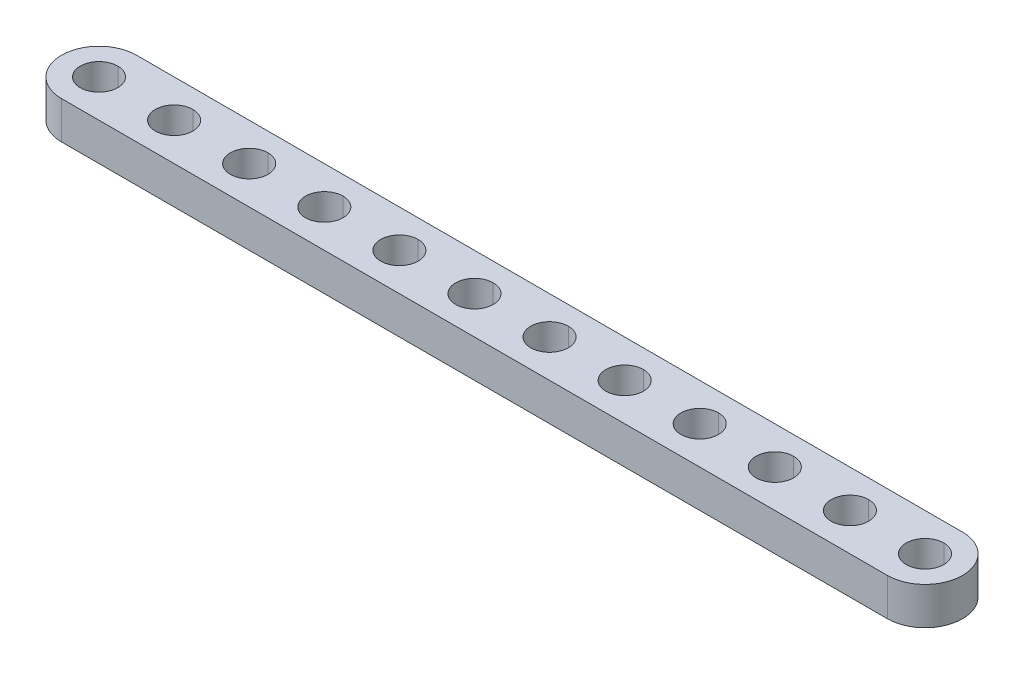
ISO-10303-21;
HEADER;
FILE_DESCRIPTION(('STEP AP214'),'2;1');
FILE_NAME('part.step','',(''),(''),'','','');
FILE_SCHEMA(('AUTOMOTIVE_DESIGN { 1 0 10303 214 1 1 1 1 }'));
ENDSEC;
DATA;
#1=APPLICATION_CONTEXT('core data for automotive mechanical design processes');
#2=APPLICATION_PROTOCOL_DEFINITION('international standard','automotive_design',2000,#1);
#3=PRODUCT_CONTEXT('',#1,'mechanical');
#4=PRODUCT('Part','Part','',(#3));
#5=PRODUCT_RELATED_PRODUCT_CATEGORY('part','',(#4));
#6=PRODUCT_DEFINITION_FORMATION('','',#4);
#7=PRODUCT_DEFINITION_CONTEXT('part definition',#1,'design');
#8=PRODUCT_DEFINITION('design','',#6,#7);
#9=PRODUCT_DEFINITION_SHAPE('','',#8);
#10=(LENGTH_UNIT() NAMED_UNIT(*) SI_UNIT(.MILLI.,.METRE.));
#11=(NAMED_UNIT(*) PLANE_ANGLE_UNIT() SI_UNIT($,.RADIAN.));
#12=(NAMED_UNIT(*) SI_UNIT($,.STERADIAN.) SOLID_ANGLE_UNIT());
#13=UNCERTAINTY_MEASURE_WITH_UNIT(LENGTH_MEASURE(1.E-05),#10,'distance_accuracy_value','');
#14=(GEOMETRIC_REPRESENTATION_CONTEXT(3) GLOBAL_UNCERTAINTY_ASSIGNED_CONTEXT((#13)) GLOBAL_UNIT_ASSIGNED_CONTEXT((#10,
#11,#12)) REPRESENTATION_CONTEXT('',''));
#15=CARTESIAN_POINT('',(0.,0.,0.));
#16=DIRECTION('',(0.,0.,1.));
#17=DIRECTION('',(1.,0.,0.));
#18=AXIS2_PLACEMENT_3D('',#15,#16,#17);
#19=CARTESIAN_POINT('',(44.,4.,0.));
#20=DIRECTION('',(0.,1.,0.));
#21=DIRECTION('',(0.,0.,1.));
#22=AXIS2_PLACEMENT_3D('',#19,#20,#21);
#23=CYLINDRICAL_SURFACE('',#22,2.);
#24=DIRECTION('',(0.,1.,0.));
#25=VECTOR('',#24,1.);
#26=CARTESIAN_POINT('',(44.,4.,-2.));
#27=LINE('',#26,#25);
#28=CARTESIAN_POINT('',(44.,0.,-2.));
#29=VERTEX_POINT('',#28);
#30=CARTESIAN_POINT('',(44.,4.,-2.));
#31=VERTEX_POINT('',#30);
#32=EDGE_CURVE('E379',#29,#31,#27,.T.);
#33=ORIENTED_EDGE('',*,*,#32,.F.);
#34=CARTESIAN_POINT('',(44.,0.,0.));
#35=DIRECTION('',(0.,1.,0.));
#36=DIRECTION('',(0.,0.,1.));
#37=AXIS2_PLACEMENT_3D('',#34,#35,#36);
#38=CIRCLE('',#37,2.);
#39=CARTESIAN_POINT('',(44.,0.,2.));
#40=VERTEX_POINT('',#39);
#41=EDGE_CURVE('E300',#40,#29,#38,.T.);
#42=ORIENTED_EDGE('',*,*,#41,.F.);
#43=DIRECTION('',(0.,1.,0.));
#44=VECTOR('',#43,1.);
#45=CARTESIAN_POINT('',(44.,4.,2.));
#46=LINE('',#45,#44);
#47=CARTESIAN_POINT('',(44.,4.,2.));
#48=VERTEX_POINT('',#47);
#49=EDGE_CURVE('E363',#40,#48,#46,.T.);
#50=ORIENTED_EDGE('',*,*,#49,.T.);
#51=CARTESIAN_POINT('',(44.,4.,0.));
#52=DIRECTION('',(0.,1.,0.));
#53=DIRECTION('',(0.,0.,1.));
#54=AXIS2_PLACEMENT_3D('',#51,#52,#53);
#55=CIRCLE('',#54,2.);
#56=EDGE_CURVE('E308',#48,#31,#55,.T.);
#57=ORIENTED_EDGE('',*,*,#56,.T.);
#58=EDGE_LOOP('',(#33,#42,#50,#57));
#59=FACE_BOUND('',#58,.T.);
#60=ADVANCED_FACE('F14',(#59),#23,.F.);
#61=CARTESIAN_POINT('',(36.,4.,0.));
#62=DIRECTION('',(0.,1.,0.));
#63=DIRECTION('',(0.,0.,1.));
#64=AXIS2_PLACEMENT_3D('',#61,#62,#63);
#65=CYLINDRICAL_SURFACE('',#64,2.);
#66=DIRECTION('',(0.,1.,0.));
#67=VECTOR('',#66,1.);
#68=CARTESIAN_POINT('',(36.,4.,-2.));
#69=LINE('',#68,#67);
#70=CARTESIAN_POINT('',(36.,0.,-2.));
#71=VERTEX_POINT('',#70);
#72=CARTESIAN_POINT('',(36.,4.,-2.));
#73=VERTEX_POINT('',#72);
#74=EDGE_CURVE('E332',#71,#73,#69,.T.);
#75=ORIENTED_EDGE('',*,*,#74,.F.);
#76=CARTESIAN_POINT('',(36.,0.,0.));
#77=DIRECTION('',(0.,1.,0.));
#78=DIRECTION('',(0.,0.,1.));
#79=AXIS2_PLACEMENT_3D('',#76,#77,#78);
#80=CIRCLE('',#79,2.);
#81=CARTESIAN_POINT('',(36.,0.,2.));
#82=VERTEX_POINT('',#81);
#83=EDGE_CURVE('E312',#82,#71,#80,.T.);
#84=ORIENTED_EDGE('',*,*,#83,.F.);
#85=DIRECTION('',(0.,1.,0.));
#86=VECTOR('',#85,1.);
#87=CARTESIAN_POINT('',(36.,4.,2.));
#88=LINE('',#87,#86);
#89=CARTESIAN_POINT('',(36.,4.,2.));
#90=VERTEX_POINT('',#89);
#91=EDGE_CURVE('E331',#82,#90,#88,.T.);
#92=ORIENTED_EDGE('',*,*,#91,.T.);
#93=CARTESIAN_POINT('',(36.,4.,0.));
#94=DIRECTION('',(0.,1.,0.));
#95=DIRECTION('',(0.,0.,1.));
#96=AXIS2_PLACEMENT_3D('',#93,#94,#95);
#97=CIRCLE('',#96,2.);
#98=EDGE_CURVE('E311',#90,#73,#97,.T.);
#99=ORIENTED_EDGE('',*,*,#98,.T.);
#100=EDGE_LOOP('',(#75,#84,#92,#99));
#101=FACE_BOUND('',#100,.T.);
#102=ADVANCED_FACE('F16',(#101),#65,.F.);
#103=CARTESIAN_POINT('',(28.,4.,0.));
#104=DIRECTION('',(0.,1.,0.));
#105=DIRECTION('',(0.,0.,1.));
#106=AXIS2_PLACEMENT_3D('',#103,#104,#105);
#107=CYLINDRICAL_SURFACE('',#106,2.);
#108=DIRECTION('',(0.,1.,0.));
#109=VECTOR('',#108,1.);
#110=CARTESIAN_POINT('',(28.,4.,-2.));
#111=LINE('',#110,#109);
#112=CARTESIAN_POINT('',(28.,0.,-2.));
#113=VERTEX_POINT('',#112);
#114=CARTESIAN_POINT('',(28.,4.,-2.));
#115=VERTEX_POINT('',#114);
#116=EDGE_CURVE('E351',#113,#115,#111,.T.);
#117=ORIENTED_EDGE('',*,*,#116,.F.);
#118=CARTESIAN_POINT('',(28.,0.,0.));
#119=DIRECTION('',(0.,1.,0.));
#120=DIRECTION('',(0.,0.,1.));
#121=AXIS2_PLACEMENT_3D('',#118,#119,#120);
#122=CIRCLE('',#121,2.);
#123=CARTESIAN_POINT('',(28.,0.,2.));
#124=VERTEX_POINT('',#123);
#125=EDGE_CURVE('E315',#124,#113,#122,.T.);
#126=ORIENTED_EDGE('',*,*,#125,.F.);
#127=DIRECTION('',(0.,1.,0.));
#128=VECTOR('',#127,1.);
#129=CARTESIAN_POINT('',(28.,4.,2.));
#130=LINE('',#129,#128);
#131=CARTESIAN_POINT('',(28.,4.,2.));
#132=VERTEX_POINT('',#131);
#133=EDGE_CURVE('E302',#124,#132,#130,.T.);
#134=ORIENTED_EDGE('',*,*,#133,.T.);
#135=CARTESIAN_POINT('',(28.,4.,0.));
#136=DIRECTION('',(0.,1.,0.));
#137=DIRECTION('',(0.,0.,1.));
#138=AXIS2_PLACEMENT_3D('',#135,#136,#137);
#139=CIRCLE('',#138,2.);
#140=EDGE_CURVE('E480',#132,#115,#139,.T.);
#141=ORIENTED_EDGE('',*,*,#140,.T.);
#142=EDGE_LOOP('',(#117,#126,#134,#141));
#143=FACE_BOUND('',#142,.T.);
#144=ADVANCED_FACE('F807',(#143),#107,.F.);
#145=CARTESIAN_POINT('',(20.,4.,0.));
#146=DIRECTION('',(0.,1.,0.));
#147=DIRECTION('',(0.,0.,1.));
#148=AXIS2_PLACEMENT_3D('',#145,#146,#147);
#149=CYLINDRICAL_SURFACE('',#148,2.);
#150=DIRECTION('',(0.,1.,0.));
#151=VECTOR('',#150,1.);
#152=CARTESIAN_POINT('',(20.,4.,-2.));
#153=LINE('',#152,#151);
#154=CARTESIAN_POINT('',(20.,0.,-2.));
#155=VERTEX_POINT('',#154);
#156=CARTESIAN_POINT('',(20.,4.,-2.));
#157=VERTEX_POINT('',#156);
#158=EDGE_CURVE('E384',#155,#157,#153,.T.);
#159=ORIENTED_EDGE('',*,*,#158,.F.);
#160=CARTESIAN_POINT('',(20.,0.,0.));
#161=DIRECTION('',(0.,1.,0.));
#162=DIRECTION('',(0.,0.,1.));
#163=AXIS2_PLACEMENT_3D('',#160,#161,#162);
#164=CIRCLE('',#163,2.);
#165=CARTESIAN_POINT('',(20.,0.,2.));
#166=VERTEX_POINT('',#165);
#167=EDGE_CURVE('E435',#166,#155,#164,.T.);
#168=ORIENTED_EDGE('',*,*,#167,.F.);
#169=DIRECTION('',(0.,1.,0.));
#170=VECTOR('',#169,1.);
#171=CARTESIAN_POINT('',(20.,4.,2.));
#172=LINE('',#171,#170);
#173=CARTESIAN_POINT('',(20.,4.,2.));
#174=VERTEX_POINT('',#173);
#175=EDGE_CURVE('E342',#166,#174,#172,.T.);
#176=ORIENTED_EDGE('',*,*,#175,.T.);
#177=CARTESIAN_POINT('',(20.,4.,0.));
#178=DIRECTION('',(0.,1.,0.));
#179=DIRECTION('',(0.,0.,1.));
#180=AXIS2_PLACEMENT_3D('',#177,#178,#179);
#181=CIRCLE('',#180,2.);
#182=EDGE_CURVE('E508',#174,#157,#181,.T.);
#183=ORIENTED_EDGE('',*,*,#182,.T.);
#184=EDGE_LOOP('',(#159,#168,#176,#183));
#185=FACE_BOUND('',#184,.T.);
#186=ADVANCED_FACE('F870',(#185),#149,.F.);
#187=CARTESIAN_POINT('',(12.,4.,0.));
#188=DIRECTION('',(0.,1.,0.));
#189=DIRECTION('',(0.,0.,1.));
#190=AXIS2_PLACEMENT_3D('',#187,#188,#189);
#191=CYLINDRICAL_SURFACE('',#190,2.);
#192=DIRECTION('',(0.,1.,0.));
#193=VECTOR('',#192,1.);
#194=CARTESIAN_POINT('',(12.,4.,-2.));
#195=LINE('',#194,#193);
#196=CARTESIAN_POINT('',(12.,0.,-2.));
#197=VERTEX_POINT('',#196);
#198=CARTESIAN_POINT('',(12.,4.,-2.));
#199=VERTEX_POINT('',#198);
#200=EDGE_CURVE('E341',#197,#199,#195,.T.);
#201=ORIENTED_EDGE('',*,*,#200,.F.);
#202=CARTESIAN_POINT('',(12.,0.,0.));
#203=DIRECTION('',(0.,1.,0.));
#204=DIRECTION('',(0.,0.,1.));
#205=AXIS2_PLACEMENT_3D('',#202,#203,#204);
#206=CIRCLE('',#205,2.);
#207=CARTESIAN_POINT('',(12.,0.,2.));
#208=VERTEX_POINT('',#207);
#209=EDGE_CURVE('E432',#208,#197,#206,.T.);
#210=ORIENTED_EDGE('',*,*,#209,.F.);
#211=DIRECTION('',(0.,1.,0.));
#212=VECTOR('',#211,1.);
#213=CARTESIAN_POINT('',(12.,4.,2.));
#214=LINE('',#213,#212);
#215=CARTESIAN_POINT('',(12.,4.,2.));
#216=VERTEX_POINT('',#215);
#217=EDGE_CURVE('E492',#208,#216,#214,.T.);
#218=ORIENTED_EDGE('',*,*,#217,.T.);
#219=CARTESIAN_POINT('',(12.,4.,0.));
#220=DIRECTION('',(0.,1.,0.));
#221=DIRECTION('',(0.,0.,1.));
#222=AXIS2_PLACEMENT_3D('',#219,#220,#221);
#223=CIRCLE('',#222,2.);
#224=EDGE_CURVE('E511',#216,#199,#223,.T.);
#225=ORIENTED_EDGE('',*,*,#224,.T.);
#226=EDGE_LOOP('',(#201,#210,#218,#225));
#227=FACE_BOUND('',#226,.T.);
#228=ADVANCED_FACE('F817',(#227),#191,.F.);
#229=CARTESIAN_POINT('',(4.,4.,0.));
#230=DIRECTION('',(0.,1.,0.));
#231=DIRECTION('',(0.,0.,1.));
#232=AXIS2_PLACEMENT_3D('',#229,#230,#231);
#233=CYLINDRICAL_SURFACE('',#232,2.);
#234=DIRECTION('',(0.,1.,0.));
#235=VECTOR('',#234,1.);
#236=CARTESIAN_POINT('',(4.,4.,-2.));
#237=LINE('',#236,#235);
#238=CARTESIAN_POINT('',(4.,0.,-2.));
#239=VERTEX_POINT('',#238);
#240=CARTESIAN_POINT('',(4.,4.,-2.));
#241=VERTEX_POINT('',#240);
#242=EDGE_CURVE('E316',#239,#241,#237,.T.);
#243=ORIENTED_EDGE('',*,*,#242,.F.);
#244=CARTESIAN_POINT('',(4.,0.,0.));
#245=DIRECTION('',(0.,1.,0.));
#246=DIRECTION('',(0.,0.,1.));
#247=AXIS2_PLACEMENT_3D('',#244,#245,#246);
#248=CIRCLE('',#247,2.);
#249=CARTESIAN_POINT('',(4.,0.,2.));
#250=VERTEX_POINT('',#249);
#251=EDGE_CURVE('E395',#250,#239,#248,.T.);
#252=ORIENTED_EDGE('',*,*,#251,.F.);
#253=DIRECTION('',(0.,1.,0.));
#254=VECTOR('',#253,1.);
#255=CARTESIAN_POINT('',(4.,4.,2.));
#256=LINE('',#255,#254);
#257=CARTESIAN_POINT('',(4.,4.,2.));
#258=VERTEX_POINT('',#257);
#259=EDGE_CURVE('E444',#250,#258,#256,.T.);
#260=ORIENTED_EDGE('',*,*,#259,.T.);
#261=CARTESIAN_POINT('',(4.,4.,0.));
#262=DIRECTION('',(0.,1.,0.));
#263=DIRECTION('',(0.,0.,1.));
#264=AXIS2_PLACEMENT_3D('',#261,#262,#263);
#265=CIRCLE('',#264,2.);
#266=EDGE_CURVE('E362',#258,#241,#265,.T.);
#267=ORIENTED_EDGE('',*,*,#266,.T.);
#268=EDGE_LOOP('',(#243,#252,#260,#267));
#269=FACE_BOUND('',#268,.T.);
#270=ADVANCED_FACE('F812',(#269),#233,.F.);
#271=CARTESIAN_POINT('',(-4.,4.,0.));
#272=DIRECTION('',(0.,1.,0.));
#273=DIRECTION('',(0.,0.,1.));
#274=AXIS2_PLACEMENT_3D('',#271,#272,#273);
#275=CYLINDRICAL_SURFACE('',#274,2.);
#276=DIRECTION('',(0.,1.,0.));
#277=VECTOR('',#276,1.);
#278=CARTESIAN_POINT('',(-4.,4.,-2.));
#279=LINE('',#278,#277);
#280=CARTESIAN_POINT('',(-4.,0.,-2.));
#281=VERTEX_POINT('',#280);
#282=CARTESIAN_POINT('',(-4.,4.,-2.));
#283=VERTEX_POINT('',#282);
#284=EDGE_CURVE('E453',#281,#283,#279,.T.);
#285=ORIENTED_EDGE('',*,*,#284,.F.);
#286=CARTESIAN_POINT('',(-4.,0.,0.));
#287=DIRECTION('',(0.,1.,0.));
#288=DIRECTION('',(0.,0.,1.));
#289=AXIS2_PLACEMENT_3D('',#286,#287,#288);
#290=CIRCLE('',#289,2.);
#291=CARTESIAN_POINT('',(-4.,0.,2.));
#292=VERTEX_POINT('',#291);
#293=EDGE_CURVE('E393',#292,#281,#290,.T.);
#294=ORIENTED_EDGE('',*,*,#293,.F.);
#295=DIRECTION('',(0.,1.,0.));
#296=VECTOR('',#295,1.);
#297=CARTESIAN_POINT('',(-4.,4.,2.));
#298=LINE('',#297,#296);
#299=CARTESIAN_POINT('',(-4.,4.,2.));
#300=VERTEX_POINT('',#299);
#301=EDGE_CURVE('E422',#292,#300,#298,.T.);
#302=ORIENTED_EDGE('',*,*,#301,.T.);
#303=CARTESIAN_POINT('',(-4.,4.,0.));
#304=DIRECTION('',(0.,1.,0.));
#305=DIRECTION('',(0.,0.,1.));
#306=AXIS2_PLACEMENT_3D('',#303,#304,#305);
#307=CIRCLE('',#306,2.);
#308=EDGE_CURVE('E358',#300,#283,#307,.T.);
#309=ORIENTED_EDGE('',*,*,#308,.T.);
#310=EDGE_LOOP('',(#285,#294,#302,#309));
#311=FACE_BOUND('',#310,.T.);
#312=ADVANCED_FACE('F816',(#311),#275,.F.);
#313=CARTESIAN_POINT('',(-12.,4.,0.));
#314=DIRECTION('',(0.,1.,0.));
#315=DIRECTION('',(0.,0.,1.));
#316=AXIS2_PLACEMENT_3D('',#313,#314,#315);
#317=CYLINDRICAL_SURFACE('',#316,2.);
#318=DIRECTION('',(0.,1.,0.));
#319=VECTOR('',#318,1.);
#320=CARTESIAN_POINT('',(-12.,4.,-2.));
#321=LINE('',#320,#319);
#322=CARTESIAN_POINT('',(-12.,0.,-2.));
#323=VERTEX_POINT('',#322);
#324=CARTESIAN_POINT('',(-12.,4.,-2.));
#325=VERTEX_POINT('',#324);
#326=EDGE_CURVE('E352',#323,#325,#321,.T.);
#327=ORIENTED_EDGE('',*,*,#326,.F.);
#328=CARTESIAN_POINT('',(-12.,0.,0.));
#329=DIRECTION('',(0.,1.,0.));
#330=DIRECTION('',(0.,0.,1.));
#331=AXIS2_PLACEMENT_3D('',#328,#329,#330);
#332=CIRCLE('',#331,2.);
#333=CARTESIAN_POINT('',(-12.,0.,2.));
#334=VERTEX_POINT('',#333);
#335=EDGE_CURVE('E392',#334,#323,#332,.T.);
#336=ORIENTED_EDGE('',*,*,#335,.F.);
#337=DIRECTION('',(0.,1.,0.));
#338=VECTOR('',#337,1.);
#339=CARTESIAN_POINT('',(-12.,4.,2.));
#340=LINE('',#339,#338);
#341=CARTESIAN_POINT('',(-12.,4.,2.));
#342=VERTEX_POINT('',#341);
#343=EDGE_CURVE('E423',#334,#342,#340,.T.);
#344=ORIENTED_EDGE('',*,*,#343,.T.);
#345=CARTESIAN_POINT('',(-12.,4.,0.));
#346=DIRECTION('',(0.,1.,0.));
#347=DIRECTION('',(0.,0.,1.));
#348=AXIS2_PLACEMENT_3D('',#345,#346,#347);
#349=CIRCLE('',#348,2.);
#350=EDGE_CURVE('E361',#342,#325,#349,.T.);
#351=ORIENTED_EDGE('',*,*,#350,.T.);
#352=EDGE_LOOP('',(#327,#336,#344,#351));
#353=FACE_BOUND('',#352,.T.);
#354=ADVANCED_FACE('F922',(#353),#317,.F.);
#355=CARTESIAN_POINT('',(-20.,4.,0.));
#356=DIRECTION('',(0.,1.,0.));
#357=DIRECTION('',(0.,0.,1.));
#358=AXIS2_PLACEMENT_3D('',#355,#356,#357);
#359=CYLINDRICAL_SURFACE('',#358,2.);
#360=DIRECTION('',(0.,1.,0.));
#361=VECTOR('',#360,1.);
#362=CARTESIAN_POINT('',(-20.,4.,-2.));
#363=LINE('',#362,#361);
#364=CARTESIAN_POINT('',(-20.,0.,-2.));
#365=VERTEX_POINT('',#364);
#366=CARTESIAN_POINT('',(-20.,4.,-2.));
#367=VERTEX_POINT('',#366);
#368=EDGE_CURVE('E411',#365,#367,#363,.T.);
#369=ORIENTED_EDGE('',*,*,#368,.F.);
#370=CARTESIAN_POINT('',(-20.,0.,0.));
#371=DIRECTION('',(0.,1.,0.));
#372=DIRECTION('',(0.,0.,1.));
#373=AXIS2_PLACEMENT_3D('',#370,#371,#372);
#374=CIRCLE('',#373,2.);
#375=CARTESIAN_POINT('',(-20.,0.,2.));
#376=VERTEX_POINT('',#375);
#377=EDGE_CURVE('E388',#376,#365,#374,.T.);
#378=ORIENTED_EDGE('',*,*,#377,.F.);
#379=DIRECTION('',(0.,1.,0.));
#380=VECTOR('',#379,1.);
#381=CARTESIAN_POINT('',(-20.,4.,2.));
#382=LINE('',#381,#380);
#383=CARTESIAN_POINT('',(-20.,4.,2.));
#384=VERTEX_POINT('',#383);
#385=EDGE_CURVE('E431',#376,#384,#382,.T.);
#386=ORIENTED_EDGE('',*,*,#385,.T.);
#387=CARTESIAN_POINT('',(-20.,4.,0.));
#388=DIRECTION('',(0.,1.,0.));
#389=DIRECTION('',(0.,0.,1.));
#390=AXIS2_PLACEMENT_3D('',#387,#388,#389);
#391=CIRCLE('',#390,2.);
#392=EDGE_CURVE('E336',#384,#367,#391,.T.);
#393=ORIENTED_EDGE('',*,*,#392,.T.);
#394=EDGE_LOOP('',(#369,#378,#386,#393));
#395=FACE_BOUND('',#394,.T.);
#396=ADVANCED_FACE('F918',(#395),#359,.F.);
#397=CARTESIAN_POINT('',(-28.,4.,0.));
#398=DIRECTION('',(0.,1.,0.));
#399=DIRECTION('',(0.,0.,1.));
#400=AXIS2_PLACEMENT_3D('',#397,#398,#399);
#401=CYLINDRICAL_SURFACE('',#400,2.);
#402=DIRECTION('',(0.,1.,0.));
#403=VECTOR('',#402,1.);
#404=CARTESIAN_POINT('',(-28.,4.,-2.));
#405=LINE('',#404,#403);
#406=CARTESIAN_POINT('',(-28.,0.,-2.));
#407=VERTEX_POINT('',#406);
#408=CARTESIAN_POINT('',(-28.,4.,-2.));
#409=VERTEX_POINT('',#408);
#410=EDGE_CURVE('E402',#407,#409,#405,.T.);
#411=ORIENTED_EDGE('',*,*,#410,.F.);
#412=CARTESIAN_POINT('',(-28.,0.,0.));
#413=DIRECTION('',(0.,1.,0.));
#414=DIRECTION('',(0.,0.,1.));
#415=AXIS2_PLACEMENT_3D('',#412,#413,#414);
#416=CIRCLE('',#415,2.);
#417=CARTESIAN_POINT('',(-28.,0.,2.));
#418=VERTEX_POINT('',#417);
#419=EDGE_CURVE('E391',#418,#407,#416,.T.);
#420=ORIENTED_EDGE('',*,*,#419,.F.);
#421=DIRECTION('',(0.,1.,0.));
#422=VECTOR('',#421,1.);
#423=CARTESIAN_POINT('',(-28.,4.,2.));
#424=LINE('',#423,#422);
#425=CARTESIAN_POINT('',(-28.,4.,2.));
#426=VERTEX_POINT('',#425);
#427=EDGE_CURVE('E401',#418,#426,#424,.T.);
#428=ORIENTED_EDGE('',*,*,#427,.T.);
#429=CARTESIAN_POINT('',(-28.,4.,0.));
#430=DIRECTION('',(0.,1.,0.));
#431=DIRECTION('',(0.,0.,1.));
#432=AXIS2_PLACEMENT_3D('',#429,#430,#431);
#433=CIRCLE('',#432,2.);
#434=EDGE_CURVE('E333',#426,#409,#433,.T.);
#435=ORIENTED_EDGE('',*,*,#434,.T.);
#436=EDGE_LOOP('',(#411,#420,#428,#435));
#437=FACE_BOUND('',#436,.T.);
#438=ADVANCED_FACE('F558',(#437),#401,.F.);
#439=CARTESIAN_POINT('',(-36.,4.,0.));
#440=DIRECTION('',(0.,1.,0.));
#441=DIRECTION('',(0.,0.,1.));
#442=AXIS2_PLACEMENT_3D('',#439,#440,#441);
#443=CYLINDRICAL_SURFACE('',#442,2.);
#444=DIRECTION('',(0.,1.,0.));
#445=VECTOR('',#444,1.);
#446=CARTESIAN_POINT('',(-36.,4.,-2.));
#447=LINE('',#446,#445);
#448=CARTESIAN_POINT('',(-36.,0.,-2.));
#449=VERTEX_POINT('',#448);
#450=CARTESIAN_POINT('',(-36.,4.,-2.));
#451=VERTEX_POINT('',#450);
#452=EDGE_CURVE('E407',#449,#451,#447,.T.);
#453=ORIENTED_EDGE('',*,*,#452,.F.);
#454=CARTESIAN_POINT('',(-36.,0.,0.));
#455=DIRECTION('',(0.,1.,0.));
#456=DIRECTION('',(0.,0.,1.));
#457=AXIS2_PLACEMENT_3D('',#454,#455,#456);
#458=CIRCLE('',#457,2.);
#459=CARTESIAN_POINT('',(-36.,0.,2.));
#460=VERTEX_POINT('',#459);
#461=EDGE_CURVE('E25',#460,#449,#458,.T.);
#462=ORIENTED_EDGE('',*,*,#461,.F.);
#463=DIRECTION('',(0.,1.,0.));
#464=VECTOR('',#463,1.);
#465=CARTESIAN_POINT('',(-36.,4.,2.));
#466=LINE('',#465,#464);
#467=CARTESIAN_POINT('',(-36.,4.,2.));
#468=VERTEX_POINT('',#467);
#469=EDGE_CURVE('E369',#460,#468,#466,.T.);
#470=ORIENTED_EDGE('',*,*,#469,.T.);
#471=CARTESIAN_POINT('',(-36.,4.,0.));
#472=DIRECTION('',(0.,1.,0.));
#473=DIRECTION('',(0.,0.,1.));
#474=AXIS2_PLACEMENT_3D('',#471,#472,#473);
#475=CIRCLE('',#474,2.);
#476=EDGE_CURVE('E301',#468,#451,#475,.T.);
#477=ORIENTED_EDGE('',*,*,#476,.T.);
#478=EDGE_LOOP('',(#453,#462,#470,#477));
#479=FACE_BOUND('',#478,.T.);
#480=ADVANCED_FACE('F858',(#479),#443,.F.);
#481=CARTESIAN_POINT('',(-44.,4.,0.));
#482=DIRECTION('',(0.,1.,0.));
#483=DIRECTION('',(0.,0.,1.));
#484=AXIS2_PLACEMENT_3D('',#481,#482,#483);
#485=CYLINDRICAL_SURFACE('',#484,2.);
#486=DIRECTION('',(0.,1.,0.));
#487=VECTOR('',#486,1.);
#488=CARTESIAN_POINT('',(-44.,4.,-2.));
#489=LINE('',#488,#487);
#490=CARTESIAN_POINT('',(-44.,0.,-2.));
#491=VERTEX_POINT('',#490);
#492=CARTESIAN_POINT('',(-44.,4.,-2.));
#493=VERTEX_POINT('',#492);
#494=EDGE_CURVE('E296',#491,#493,#489,.T.);
#495=ORIENTED_EDGE('',*,*,#494,.F.);
#496=CARTESIAN_POINT('',(-44.,0.,0.));
#497=DIRECTION('',(0.,1.,0.));
#498=DIRECTION('',(0.,0.,1.));
#499=AXIS2_PLACEMENT_3D('',#496,#497,#498);
#500=CIRCLE('',#499,2.);
#501=CARTESIAN_POINT('',(-44.,0.,2.));
#502=VERTEX_POINT('',#501);
#503=EDGE_CURVE('E9',#502,#491,#500,.T.);
#504=ORIENTED_EDGE('',*,*,#503,.F.);
#505=DIRECTION('',(0.,1.,0.));
#506=VECTOR('',#505,1.);
#507=CARTESIAN_POINT('',(-44.,4.,2.));
#508=LINE('',#507,#506);
#509=CARTESIAN_POINT('',(-44.,4.,2.));
#510=VERTEX_POINT('',#509);
#511=EDGE_CURVE('E463',#502,#510,#508,.T.);
#512=ORIENTED_EDGE('',*,*,#511,.T.);
#513=CARTESIAN_POINT('',(-44.,4.,0.));
#514=DIRECTION('',(0.,1.,0.));
#515=DIRECTION('',(0.,0.,1.));
#516=AXIS2_PLACEMENT_3D('',#513,#514,#515);
#517=CIRCLE('',#516,2.);
#518=EDGE_CURVE('E298',#510,#493,#517,.T.);
#519=ORIENTED_EDGE('',*,*,#518,.T.);
#520=EDGE_LOOP('',(#495,#504,#512,#519));
#521=FACE_BOUND('',#520,.T.);
#522=ADVANCED_FACE('F597',(#521),#485,.F.);
#523=CARTESIAN_POINT('',(-44.,0.,0.));
#524=DIRECTION('',(0.,1.,0.));
#525=DIRECTION('',(1.,0.,0.));
#526=AXIS2_PLACEMENT_3D('',#523,#524,#525);
#527=PLANE('',#526);
#528=ORIENTED_EDGE('',*,*,#503,.T.);
#529=CARTESIAN_POINT('',(-44.,0.,0.));
#530=DIRECTION('',(0.,1.,0.));
#531=DIRECTION('',(0.,0.,1.));
#532=AXIS2_PLACEMENT_3D('',#529,#530,#531);
#533=CIRCLE('',#532,2.);
#534=EDGE_CURVE('E373',#491,#502,#533,.T.);
#535=ORIENTED_EDGE('',*,*,#534,.T.);
#536=EDGE_LOOP('',(#528,#535));
#537=FACE_BOUND('',#536,.T.);
#538=ORIENTED_EDGE('',*,*,#461,.T.);
#539=CARTESIAN_POINT('',(-36.,0.,0.));
#540=DIRECTION('',(0.,1.,0.));
#541=DIRECTION('',(0.,0.,1.));
#542=AXIS2_PLACEMENT_3D('',#539,#540,#541);
#543=CIRCLE('',#542,2.);
#544=EDGE_CURVE('E403',#449,#460,#543,.T.);
#545=ORIENTED_EDGE('',*,*,#544,.T.);
#546=EDGE_LOOP('',(#538,#545));
#547=FACE_BOUND('',#546,.T.);
#548=ORIENTED_EDGE('',*,*,#419,.T.);
#549=CARTESIAN_POINT('',(-28.,0.,0.));
#550=DIRECTION('',(0.,1.,0.));
#551=DIRECTION('',(0.,0.,1.));
#552=AXIS2_PLACEMENT_3D('',#549,#550,#551);
#553=CIRCLE('',#552,2.);
#554=EDGE_CURVE('E427',#407,#418,#553,.T.);
#555=ORIENTED_EDGE('',*,*,#554,.T.);
#556=EDGE_LOOP('',(#548,#555));
#557=FACE_BOUND('',#556,.T.);
#558=ORIENTED_EDGE('',*,*,#377,.T.);
#559=CARTESIAN_POINT('',(-20.,0.,0.));
#560=DIRECTION('',(0.,1.,0.));
#561=DIRECTION('',(0.,0.,1.));
#562=AXIS2_PLACEMENT_3D('',#559,#560,#561);
#563=CIRCLE('',#562,2.);
#564=EDGE_CURVE('E415',#365,#376,#563,.T.);
#565=ORIENTED_EDGE('',*,*,#564,.T.);
#566=EDGE_LOOP('',(#558,#565));
#567=FACE_BOUND('',#566,.T.);
#568=ORIENTED_EDGE('',*,*,#335,.T.);
#569=CARTESIAN_POINT('',(-12.,0.,0.));
#570=DIRECTION('',(0.,1.,0.));
#571=DIRECTION('',(0.,0.,1.));
#572=AXIS2_PLACEMENT_3D('',#569,#570,#571);
#573=CIRCLE('',#572,2.);
#574=EDGE_CURVE('E357',#323,#334,#573,.T.);
#575=ORIENTED_EDGE('',*,*,#574,.T.);
#576=EDGE_LOOP('',(#568,#575));
#577=FACE_BOUND('',#576,.T.);
#578=ORIENTED_EDGE('',*,*,#293,.T.);
#579=CARTESIAN_POINT('',(-4.,0.,0.));
#580=DIRECTION('',(0.,1.,0.));
#581=DIRECTION('',(0.,0.,1.));
#582=AXIS2_PLACEMENT_3D('',#579,#580,#581);
#583=CIRCLE('',#582,2.);
#584=EDGE_CURVE('E448',#281,#292,#583,.T.);
#585=ORIENTED_EDGE('',*,*,#584,.T.);
#586=EDGE_LOOP('',(#578,#585));
#587=FACE_BOUND('',#586,.T.);
#588=ORIENTED_EDGE('',*,*,#251,.T.);
#589=CARTESIAN_POINT('',(4.,0.,0.));
#590=DIRECTION('',(0.,1.,0.));
#591=DIRECTION('',(0.,0.,1.));
#592=AXIS2_PLACEMENT_3D('',#589,#590,#591);
#593=CIRCLE('',#592,2.);
#594=EDGE_CURVE('E321',#239,#250,#593,.T.);
#595=ORIENTED_EDGE('',*,*,#594,.T.);
#596=EDGE_LOOP('',(#588,#595));
#597=FACE_BOUND('',#596,.T.);
#598=ORIENTED_EDGE('',*,*,#209,.T.);
#599=CARTESIAN_POINT('',(12.,0.,0.));
#600=DIRECTION('',(0.,1.,0.));
#601=DIRECTION('',(0.,0.,1.));
#602=AXIS2_PLACEMENT_3D('',#599,#600,#601);
#603=CIRCLE('',#602,2.);
#604=EDGE_CURVE('E337',#197,#208,#603,.T.);
#605=ORIENTED_EDGE('',*,*,#604,.T.);
#606=EDGE_LOOP('',(#598,#605));
#607=FACE_BOUND('',#606,.T.);
#608=ORIENTED_EDGE('',*,*,#167,.T.);
#609=CARTESIAN_POINT('',(20.,0.,0.));
#610=DIRECTION('',(0.,1.,0.));
#611=DIRECTION('',(0.,0.,1.));
#612=AXIS2_PLACEMENT_3D('',#609,#610,#611);
#613=CIRCLE('',#612,2.);
#614=EDGE_CURVE('E306',#155,#166,#613,.T.);
#615=ORIENTED_EDGE('',*,*,#614,.T.);
#616=EDGE_LOOP('',(#608,#615));
#617=FACE_BOUND('',#616,.T.);
#618=ORIENTED_EDGE('',*,*,#125,.T.);
#619=CARTESIAN_POINT('',(28.,0.,0.));
#620=DIRECTION('',(0.,1.,0.));
#621=DIRECTION('',(0.,0.,1.));
#622=AXIS2_PLACEMENT_3D('',#619,#620,#621);
#623=CIRCLE('',#622,2.);
#624=EDGE_CURVE('E347',#113,#124,#623,.T.);
#625=ORIENTED_EDGE('',*,*,#624,.T.);
#626=EDGE_LOOP('',(#618,#625));
#627=FACE_BOUND('',#626,.T.);
#628=ORIENTED_EDGE('',*,*,#83,.T.);
#629=CARTESIAN_POINT('',(36.,0.,0.));
#630=DIRECTION('',(0.,1.,0.));
#631=DIRECTION('',(0.,0.,1.));
#632=AXIS2_PLACEMENT_3D('',#629,#630,#631);
#633=CIRCLE('',#632,2.);
#634=EDGE_CURVE('E367',#71,#82,#633,.T.);
#635=ORIENTED_EDGE('',*,*,#634,.T.);
#636=EDGE_LOOP('',(#628,#635));
#637=FACE_BOUND('',#636,.T.);
#638=ORIENTED_EDGE('',*,*,#41,.T.);
#639=CARTESIAN_POINT('',(44.,0.,0.));
#640=DIRECTION('',(0.,1.,0.));
#641=DIRECTION('',(0.,0.,1.));
#642=AXIS2_PLACEMENT_3D('',#639,#640,#641);
#643=CIRCLE('',#642,2.);
#644=EDGE_CURVE('E375',#29,#40,#643,.T.);
#645=ORIENTED_EDGE('',*,*,#644,.T.);
#646=EDGE_LOOP('',(#638,#645));
#647=FACE_BOUND('',#646,.T.);
#648=CARTESIAN_POINT('',(-44.,0.,0.));
#649=DIRECTION('',(0.,1.,0.));
#650=DIRECTION('',(0.,0.,1.));
#651=AXIS2_PLACEMENT_3D('',#648,#649,#650);
#652=CIRCLE('',#651,4.);
#653=CARTESIAN_POINT('',(-44.,0.,-4.));
#654=VERTEX_POINT('',#653);
#655=CARTESIAN_POINT('',(-44.,0.,4.));
#656=VERTEX_POINT('',#655);
#657=EDGE_CURVE('E459',#654,#656,#652,.T.);
#658=ORIENTED_EDGE('',*,*,#657,.F.);
#659=DIRECTION('',(-1.,0.,0.));
#660=VECTOR('',#659,1.);
#661=CARTESIAN_POINT('',(-44.,0.,-4.));
#662=LINE('',#661,#660);
#663=CARTESIAN_POINT('',(44.,0.,-4.));
#664=VERTEX_POINT('',#663);
#665=EDGE_CURVE('E269',#664,#654,#662,.T.);
#666=ORIENTED_EDGE('',*,*,#665,.F.);
#667=CARTESIAN_POINT('',(44.,0.,0.));
#668=DIRECTION('',(0.,1.,0.));
#669=DIRECTION('',(0.,0.,1.));
#670=AXIS2_PLACEMENT_3D('',#667,#668,#669);
#671=CIRCLE('',#670,4.);
#672=CARTESIAN_POINT('',(44.,0.,4.));
#673=VERTEX_POINT('',#672);
#674=EDGE_CURVE('E280',#673,#664,#671,.T.);
#675=ORIENTED_EDGE('',*,*,#674,.F.);
#676=DIRECTION('',(1.,0.,0.));
#677=VECTOR('',#676,1.);
#678=CARTESIAN_POINT('',(-44.,0.,4.));
#679=LINE('',#678,#677);
#680=EDGE_CURVE('E284',#656,#673,#679,.T.);
#681=ORIENTED_EDGE('',*,*,#680,.F.);
#682=EDGE_LOOP('',(#658,#666,#675,#681));
#683=FACE_BOUND('',#682,.T.);
#684=ADVANCED_FACE('F567',(#537,#547,#557,#567,#577,#587,#597,#607,#617,#627,#637,#647,#683),
#527,.F.);
#685=CARTESIAN_POINT('',(-44.,4.,0.));
#686=DIRECTION('',(0.,1.,0.));
#687=DIRECTION('',(1.,0.,0.));
#688=AXIS2_PLACEMENT_3D('',#685,#686,#687);
#689=PLANE('',#688);
#690=ORIENTED_EDGE('',*,*,#518,.F.);
#691=CARTESIAN_POINT('',(-44.,4.,0.));
#692=DIRECTION('',(0.,1.,0.));
#693=DIRECTION('',(0.,0.,1.));
#694=AXIS2_PLACEMENT_3D('',#691,#692,#693);
#695=CIRCLE('',#694,2.);
#696=EDGE_CURVE('E499',#493,#510,#695,.T.);
#697=ORIENTED_EDGE('',*,*,#696,.F.);
#698=EDGE_LOOP('',(#690,#697));
#699=FACE_BOUND('',#698,.T.);
#700=ORIENTED_EDGE('',*,*,#476,.F.);
#701=CARTESIAN_POINT('',(-36.,4.,0.));
#702=DIRECTION('',(0.,1.,0.));
#703=DIRECTION('',(0.,0.,1.));
#704=AXIS2_PLACEMENT_3D('',#701,#702,#703);
#705=CIRCLE('',#704,2.);
#706=EDGE_CURVE('E374',#451,#468,#705,.T.);
#707=ORIENTED_EDGE('',*,*,#706,.F.);
#708=EDGE_LOOP('',(#700,#707));
#709=FACE_BOUND('',#708,.T.);
#710=ORIENTED_EDGE('',*,*,#434,.F.);
#711=CARTESIAN_POINT('',(-28.,4.,0.));
#712=DIRECTION('',(0.,1.,0.));
#713=DIRECTION('',(0.,0.,1.));
#714=AXIS2_PLACEMENT_3D('',#711,#712,#713);
#715=CIRCLE('',#714,2.);
#716=EDGE_CURVE('E397',#409,#426,#715,.T.);
#717=ORIENTED_EDGE('',*,*,#716,.F.);
#718=EDGE_LOOP('',(#710,#717));
#719=FACE_BOUND('',#718,.T.);
#720=ORIENTED_EDGE('',*,*,#392,.F.);
#721=CARTESIAN_POINT('',(-20.,4.,0.));
#722=DIRECTION('',(0.,1.,0.));
#723=DIRECTION('',(0.,0.,1.));
#724=AXIS2_PLACEMENT_3D('',#721,#722,#723);
#725=CIRCLE('',#724,2.);
#726=EDGE_CURVE('E18',#367,#384,#725,.T.);
#727=ORIENTED_EDGE('',*,*,#726,.F.);
#728=EDGE_LOOP('',(#720,#727));
#729=FACE_BOUND('',#728,.T.);
#730=ORIENTED_EDGE('',*,*,#350,.F.);
#731=CARTESIAN_POINT('',(-12.,4.,0.));
#732=DIRECTION('',(0.,1.,0.));
#733=DIRECTION('',(0.,0.,1.));
#734=AXIS2_PLACEMENT_3D('',#731,#732,#733);
#735=CIRCLE('',#734,2.);
#736=EDGE_CURVE('E356',#325,#342,#735,.T.);
#737=ORIENTED_EDGE('',*,*,#736,.F.);
#738=EDGE_LOOP('',(#730,#737));
#739=FACE_BOUND('',#738,.T.);
#740=ORIENTED_EDGE('',*,*,#308,.F.);
#741=CARTESIAN_POINT('',(-4.,4.,0.));
#742=DIRECTION('',(0.,1.,0.));
#743=DIRECTION('',(0.,0.,1.));
#744=AXIS2_PLACEMENT_3D('',#741,#742,#743);
#745=CIRCLE('',#744,2.);
#746=EDGE_CURVE('E449',#283,#300,#745,.T.);
#747=ORIENTED_EDGE('',*,*,#746,.F.);
#748=EDGE_LOOP('',(#740,#747));
#749=FACE_BOUND('',#748,.T.);
#750=ORIENTED_EDGE('',*,*,#266,.F.);
#751=CARTESIAN_POINT('',(4.,4.,0.));
#752=DIRECTION('',(0.,1.,0.));
#753=DIRECTION('',(0.,0.,1.));
#754=AXIS2_PLACEMENT_3D('',#751,#752,#753);
#755=CIRCLE('',#754,2.);
#756=EDGE_CURVE('E320',#241,#258,#755,.T.);
#757=ORIENTED_EDGE('',*,*,#756,.F.);
#758=EDGE_LOOP('',(#750,#757));
#759=FACE_BOUND('',#758,.T.);
#760=ORIENTED_EDGE('',*,*,#224,.F.);
#761=CARTESIAN_POINT('',(12.,4.,0.));
#762=DIRECTION('',(0.,1.,0.));
#763=DIRECTION('',(0.,0.,1.));
#764=AXIS2_PLACEMENT_3D('',#761,#762,#763);
#765=CIRCLE('',#764,2.);
#766=EDGE_CURVE('E346',#199,#216,#765,.T.);
#767=ORIENTED_EDGE('',*,*,#766,.F.);
#768=EDGE_LOOP('',(#760,#767));
#769=FACE_BOUND('',#768,.T.);
#770=ORIENTED_EDGE('',*,*,#182,.F.);
#771=CARTESIAN_POINT('',(20.,4.,0.));
#772=DIRECTION('',(0.,1.,0.));
#773=DIRECTION('',(0.,0.,1.));
#774=AXIS2_PLACEMENT_3D('',#771,#772,#773);
#775=CIRCLE('',#774,2.);
#776=EDGE_CURVE('E380',#157,#174,#775,.T.);
#777=ORIENTED_EDGE('',*,*,#776,.F.);
#778=EDGE_LOOP('',(#770,#777));
#779=FACE_BOUND('',#778,.T.);
#780=ORIENTED_EDGE('',*,*,#140,.F.);
#781=CARTESIAN_POINT('',(28.,4.,0.));
#782=DIRECTION('',(0.,1.,0.));
#783=DIRECTION('',(0.,0.,1.));
#784=AXIS2_PLACEMENT_3D('',#781,#782,#783);
#785=CIRCLE('',#784,2.);
#786=EDGE_CURVE('E307',#115,#132,#785,.T.);
#787=ORIENTED_EDGE('',*,*,#786,.F.);
#788=EDGE_LOOP('',(#780,#787));
#789=FACE_BOUND('',#788,.T.);
#790=ORIENTED_EDGE('',*,*,#98,.F.);
#791=CARTESIAN_POINT('',(36.,4.,0.));
#792=DIRECTION('',(0.,1.,0.));
#793=DIRECTION('',(0.,0.,1.));
#794=AXIS2_PLACEMENT_3D('',#791,#792,#793);
#795=CIRCLE('',#794,2.);
#796=EDGE_CURVE('E327',#73,#90,#795,.T.);
#797=ORIENTED_EDGE('',*,*,#796,.F.);
#798=EDGE_LOOP('',(#790,#797));
#799=FACE_BOUND('',#798,.T.);
#800=ORIENTED_EDGE('',*,*,#56,.F.);
#801=CARTESIAN_POINT('',(44.,4.,0.));
#802=DIRECTION('',(0.,1.,0.));
#803=DIRECTION('',(0.,0.,1.));
#804=AXIS2_PLACEMENT_3D('',#801,#802,#803);
#805=CIRCLE('',#804,2.);
#806=EDGE_CURVE('E368',#31,#48,#805,.T.);
#807=ORIENTED_EDGE('',*,*,#806,.F.);
#808=EDGE_LOOP('',(#800,#807));
#809=FACE_BOUND('',#808,.T.);
#810=CARTESIAN_POINT('',(-44.,4.,0.));
#811=DIRECTION('',(0.,1.,0.));
#812=DIRECTION('',(0.,0.,1.));
#813=AXIS2_PLACEMENT_3D('',#810,#811,#812);
#814=CIRCLE('',#813,4.);
#815=CARTESIAN_POINT('',(-44.,4.,-4.));
#816=VERTEX_POINT('',#815);
#817=CARTESIAN_POINT('',(-44.,4.,4.));
#818=VERTEX_POINT('',#817);
#819=EDGE_CURVE('E275',#816,#818,#814,.T.);
#820=ORIENTED_EDGE('',*,*,#819,.T.);
#821=DIRECTION('',(1.,0.,0.));
#822=VECTOR('',#821,1.);
#823=CARTESIAN_POINT('',(-44.,4.,4.));
#824=LINE('',#823,#822);
#825=CARTESIAN_POINT('',(44.,4.,4.));
#826=VERTEX_POINT('',#825);
#827=EDGE_CURVE('E272',#818,#826,#824,.T.);
#828=ORIENTED_EDGE('',*,*,#827,.T.);
#829=CARTESIAN_POINT('',(44.,4.,0.));
#830=DIRECTION('',(0.,1.,0.));
#831=DIRECTION('',(0.,0.,1.));
#832=AXIS2_PLACEMENT_3D('',#829,#830,#831);
#833=CIRCLE('',#832,4.);
#834=CARTESIAN_POINT('',(44.,4.,-4.));
#835=VERTEX_POINT('',#834);
#836=EDGE_CURVE('E259',#826,#835,#833,.T.);
#837=ORIENTED_EDGE('',*,*,#836,.T.);
#838=DIRECTION('',(-1.,0.,0.));
#839=VECTOR('',#838,1.);
#840=CARTESIAN_POINT('',(-44.,4.,-4.));
#841=LINE('',#840,#839);
#842=EDGE_CURVE('E39',#835,#816,#841,.T.);
#843=ORIENTED_EDGE('',*,*,#842,.T.);
#844=EDGE_LOOP('',(#820,#828,#837,#843));
#845=FACE_BOUND('',#844,.T.);
#846=ADVANCED_FACE('F273',(#699,#709,#719,#729,#739,#749,#759,#769,#779,#789,#799,#809,#845),
#689,.T.);
#847=CARTESIAN_POINT('',(-44.,4.,-4.));
#848=DIRECTION('',(0.,0.,1.));
#849=DIRECTION('',(1.,0.,0.));
#850=AXIS2_PLACEMENT_3D('',#847,#848,#849);
#851=PLANE('',#850);
#852=ORIENTED_EDGE('',*,*,#665,.T.);
#853=DIRECTION('',(0.,-1.,0.));
#854=VECTOR('',#853,1.);
#855=CARTESIAN_POINT('',(-44.,4.,-4.));
#856=LINE('',#855,#854);
#857=EDGE_CURVE('E292',#816,#654,#856,.T.);
#858=ORIENTED_EDGE('',*,*,#857,.F.);
#859=ORIENTED_EDGE('',*,*,#842,.F.);
#860=DIRECTION('',(0.,-1.,0.));
#861=VECTOR('',#860,1.);
#862=CARTESIAN_POINT('',(44.,4.,-4.));
#863=LINE('',#862,#861);
#864=EDGE_CURVE('E266',#835,#664,#863,.T.);
#865=ORIENTED_EDGE('',*,*,#864,.T.);
#866=EDGE_LOOP('',(#852,#858,#859,#865));
#867=FACE_BOUND('',#866,.T.);
#868=ADVANCED_FACE('F566',(#867),#851,.F.);
#869=CARTESIAN_POINT('',(44.,4.,0.));
#870=DIRECTION('',(0.,-1.,0.));
#871=DIRECTION('',(0.,0.,-1.));
#872=AXIS2_PLACEMENT_3D('',#869,#870,#871);
#873=CYLINDRICAL_SURFACE('',#872,4.);
#874=ORIENTED_EDGE('',*,*,#674,.T.);
#875=ORIENTED_EDGE('',*,*,#864,.F.);
#876=ORIENTED_EDGE('',*,*,#836,.F.);
#877=DIRECTION('',(0.,-1.,0.));
#878=VECTOR('',#877,1.);
#879=CARTESIAN_POINT('',(44.,4.,4.));
#880=LINE('',#879,#878);
#881=EDGE_CURVE('E264',#826,#673,#880,.T.);
#882=ORIENTED_EDGE('',*,*,#881,.T.);
#883=EDGE_LOOP('',(#874,#875,#876,#882));
#884=FACE_BOUND('',#883,.T.);
#885=ADVANCED_FACE('F262',(#884),#873,.T.);
#886=CARTESIAN_POINT('',(-44.,4.,4.));
#887=DIRECTION('',(0.,0.,-1.));
#888=DIRECTION('',(0.,-1.,0.));
#889=AXIS2_PLACEMENT_3D('',#886,#887,#888);
#890=PLANE('',#889);
#891=ORIENTED_EDGE('',*,*,#680,.T.);
#892=ORIENTED_EDGE('',*,*,#881,.F.);
#893=ORIENTED_EDGE('',*,*,#827,.F.);
#894=DIRECTION('',(0.,-1.,0.));
#895=VECTOR('',#894,1.);
#896=CARTESIAN_POINT('',(-44.,4.,4.));
#897=LINE('',#896,#895);
#898=EDGE_CURVE('E326',#818,#656,#897,.T.);
#899=ORIENTED_EDGE('',*,*,#898,.T.);
#900=EDGE_LOOP('',(#891,#892,#893,#899));
#901=FACE_BOUND('',#900,.T.);
#902=ADVANCED_FACE('F282',(#901),#890,.F.);
#903=CARTESIAN_POINT('',(-44.,4.,0.));
#904=DIRECTION('',(0.,-1.,0.));
#905=DIRECTION('',(0.,0.,-1.));
#906=AXIS2_PLACEMENT_3D('',#903,#904,#905);
#907=CYLINDRICAL_SURFACE('',#906,4.);
#908=ORIENTED_EDGE('',*,*,#657,.T.);
#909=ORIENTED_EDGE('',*,*,#898,.F.);
#910=ORIENTED_EDGE('',*,*,#819,.F.);
#911=ORIENTED_EDGE('',*,*,#857,.T.);
#912=EDGE_LOOP('',(#908,#909,#910,#911));
#913=FACE_BOUND('',#912,.T.);
#914=ADVANCED_FACE('F602',(#913),#907,.T.);
#915=CARTESIAN_POINT('',(-44.,4.,0.));
#916=DIRECTION('',(0.,1.,0.));
#917=DIRECTION('',(0.,0.,1.));
#918=AXIS2_PLACEMENT_3D('',#915,#916,#917);
#919=CYLINDRICAL_SURFACE('',#918,2.);
#920=ORIENTED_EDGE('',*,*,#534,.F.);
#921=ORIENTED_EDGE('',*,*,#494,.T.);
#922=ORIENTED_EDGE('',*,*,#696,.T.);
#923=ORIENTED_EDGE('',*,*,#511,.F.);
#924=EDGE_LOOP('',(#920,#921,#922,#923));
#925=FACE_BOUND('',#924,.T.);
#926=ADVANCED_FACE('F832',(#925),#919,.F.);
#927=CARTESIAN_POINT('',(-36.,4.,0.));
#928=DIRECTION('',(0.,1.,0.));
#929=DIRECTION('',(0.,0.,1.));
#930=AXIS2_PLACEMENT_3D('',#927,#928,#929);
#931=CYLINDRICAL_SURFACE('',#930,2.);
#932=ORIENTED_EDGE('',*,*,#544,.F.);
#933=ORIENTED_EDGE('',*,*,#452,.T.);
#934=ORIENTED_EDGE('',*,*,#706,.T.);
#935=ORIENTED_EDGE('',*,*,#469,.F.);
#936=EDGE_LOOP('',(#932,#933,#934,#935));
#937=FACE_BOUND('',#936,.T.);
#938=ADVANCED_FACE('F836',(#937),#931,.F.);
#939=CARTESIAN_POINT('',(-28.,4.,0.));
#940=DIRECTION('',(0.,1.,0.));
#941=DIRECTION('',(0.,0.,1.));
#942=AXIS2_PLACEMENT_3D('',#939,#940,#941);
#943=CYLINDRICAL_SURFACE('',#942,2.);
#944=ORIENTED_EDGE('',*,*,#554,.F.);
#945=ORIENTED_EDGE('',*,*,#410,.T.);
#946=ORIENTED_EDGE('',*,*,#716,.T.);
#947=ORIENTED_EDGE('',*,*,#427,.F.);
#948=EDGE_LOOP('',(#944,#945,#946,#947));
#949=FACE_BOUND('',#948,.T.);
#950=ADVANCED_FACE('F562',(#949),#943,.F.);
#951=CARTESIAN_POINT('',(-20.,4.,0.));
#952=DIRECTION('',(0.,1.,0.));
#953=DIRECTION('',(0.,0.,1.));
#954=AXIS2_PLACEMENT_3D('',#951,#952,#953);
#955=CYLINDRICAL_SURFACE('',#954,2.);
#956=ORIENTED_EDGE('',*,*,#564,.F.);
#957=ORIENTED_EDGE('',*,*,#368,.T.);
#958=ORIENTED_EDGE('',*,*,#726,.T.);
#959=ORIENTED_EDGE('',*,*,#385,.F.);
#960=EDGE_LOOP('',(#956,#957,#958,#959));
#961=FACE_BOUND('',#960,.T.);
#962=ADVANCED_FACE('F822',(#961),#955,.F.);
#963=CARTESIAN_POINT('',(-12.,4.,0.));
#964=DIRECTION('',(0.,1.,0.));
#965=DIRECTION('',(0.,0.,1.));
#966=AXIS2_PLACEMENT_3D('',#963,#964,#965);
#967=CYLINDRICAL_SURFACE('',#966,2.);
#968=ORIENTED_EDGE('',*,*,#574,.F.);
#969=ORIENTED_EDGE('',*,*,#326,.T.);
#970=ORIENTED_EDGE('',*,*,#736,.T.);
#971=ORIENTED_EDGE('',*,*,#343,.F.);
#972=EDGE_LOOP('',(#968,#969,#970,#971));
#973=FACE_BOUND('',#972,.T.);
#974=ADVANCED_FACE('F826',(#973),#967,.F.);
#975=CARTESIAN_POINT('',(-4.,4.,0.));
#976=DIRECTION('',(0.,1.,0.));
#977=DIRECTION('',(0.,0.,1.));
#978=AXIS2_PLACEMENT_3D('',#975,#976,#977);
#979=CYLINDRICAL_SURFACE('',#978,2.);
#980=ORIENTED_EDGE('',*,*,#584,.F.);
#981=ORIENTED_EDGE('',*,*,#284,.T.);
#982=ORIENTED_EDGE('',*,*,#746,.T.);
#983=ORIENTED_EDGE('',*,*,#301,.F.);
#984=EDGE_LOOP('',(#980,#981,#982,#983));
#985=FACE_BOUND('',#984,.T.);
#986=ADVANCED_FACE('F852',(#985),#979,.F.);
#987=CARTESIAN_POINT('',(4.,4.,0.));
#988=DIRECTION('',(0.,1.,0.));
#989=DIRECTION('',(0.,0.,1.));
#990=AXIS2_PLACEMENT_3D('',#987,#988,#989);
#991=CYLINDRICAL_SURFACE('',#990,2.);
#992=ORIENTED_EDGE('',*,*,#594,.F.);
#993=ORIENTED_EDGE('',*,*,#242,.T.);
#994=ORIENTED_EDGE('',*,*,#756,.T.);
#995=ORIENTED_EDGE('',*,*,#259,.F.);
#996=EDGE_LOOP('',(#992,#993,#994,#995));
#997=FACE_BOUND('',#996,.T.);
#998=ADVANCED_FACE('F963',(#997),#991,.F.);
#999=CARTESIAN_POINT('',(12.,4.,0.));
#1000=DIRECTION('',(0.,1.,0.));
#1001=DIRECTION('',(0.,0.,1.));
#1002=AXIS2_PLACEMENT_3D('',#999,#1000,#1001);
#1003=CYLINDRICAL_SURFACE('',#1002,2.);
#1004=ORIENTED_EDGE('',*,*,#604,.F.);
#1005=ORIENTED_EDGE('',*,*,#200,.T.);
#1006=ORIENTED_EDGE('',*,*,#766,.T.);
#1007=ORIENTED_EDGE('',*,*,#217,.F.);
#1008=EDGE_LOOP('',(#1004,#1005,#1006,#1007));
#1009=FACE_BOUND('',#1008,.T.);
#1010=ADVANCED_FACE('F967',(#1009),#1003,.F.);
#1011=CARTESIAN_POINT('',(20.,4.,0.));
#1012=DIRECTION('',(0.,1.,0.));
#1013=DIRECTION('',(0.,0.,1.));
#1014=AXIS2_PLACEMENT_3D('',#1011,#1012,#1013);
#1015=CYLINDRICAL_SURFACE('',#1014,2.);
#1016=ORIENTED_EDGE('',*,*,#614,.F.);
#1017=ORIENTED_EDGE('',*,*,#158,.T.);
#1018=ORIENTED_EDGE('',*,*,#776,.T.);
#1019=ORIENTED_EDGE('',*,*,#175,.F.);
#1020=EDGE_LOOP('',(#1016,#1017,#1018,#1019));
#1021=FACE_BOUND('',#1020,.T.);
#1022=ADVANCED_FACE('F889',(#1021),#1015,.F.);
#1023=CARTESIAN_POINT('',(28.,4.,0.));
#1024=DIRECTION('',(0.,1.,0.));
#1025=DIRECTION('',(0.,0.,1.));
#1026=AXIS2_PLACEMENT_3D('',#1023,#1024,#1025);
#1027=CYLINDRICAL_SURFACE('',#1026,2.);
#1028=ORIENTED_EDGE('',*,*,#624,.F.);
#1029=ORIENTED_EDGE('',*,*,#116,.T.);
#1030=ORIENTED_EDGE('',*,*,#786,.T.);
#1031=ORIENTED_EDGE('',*,*,#133,.F.);
#1032=EDGE_LOOP('',(#1028,#1029,#1030,#1031));
#1033=FACE_BOUND('',#1032,.T.);
#1034=ADVANCED_FACE('F884',(#1033),#1027,.F.);
#1035=CARTESIAN_POINT('',(36.,4.,0.));
#1036=DIRECTION('',(0.,1.,0.));
#1037=DIRECTION('',(0.,0.,1.));
#1038=AXIS2_PLACEMENT_3D('',#1035,#1036,#1037);
#1039=CYLINDRICAL_SURFACE('',#1038,2.);
#1040=ORIENTED_EDGE('',*,*,#634,.F.);
#1041=ORIENTED_EDGE('',*,*,#74,.T.);
#1042=ORIENTED_EDGE('',*,*,#796,.T.);
#1043=ORIENTED_EDGE('',*,*,#91,.F.);
#1044=EDGE_LOOP('',(#1040,#1041,#1042,#1043));
#1045=FACE_BOUND('',#1044,.T.);
#1046=ADVANCED_FACE('F888',(#1045),#1039,.F.);
#1047=CARTESIAN_POINT('',(44.,4.,0.));
#1048=DIRECTION('',(0.,1.,0.));
#1049=DIRECTION('',(0.,0.,1.));
#1050=AXIS2_PLACEMENT_3D('',#1047,#1048,#1049);
#1051=CYLINDRICAL_SURFACE('',#1050,2.);
#1052=ORIENTED_EDGE('',*,*,#644,.F.);
#1053=ORIENTED_EDGE('',*,*,#32,.T.);
#1054=ORIENTED_EDGE('',*,*,#806,.T.);
#1055=ORIENTED_EDGE('',*,*,#49,.F.);
#1056=EDGE_LOOP('',(#1052,#1053,#1054,#1055));
#1057=FACE_BOUND('',#1056,.T.);
#1058=ADVANCED_FACE('F593',(#1057),#1051,.F.);
#1059=CLOSED_SHELL('',(#60,#102,#144,#186,#228,#270,#312,#354,#396,#438,#480,#522,#684,#846,
#868,#885,#902,#914,#926,#938,#950,#962,#974,#986,#998,#1010,#1022,#1034,#1046,#1058));
#1060=MANIFOLD_SOLID_BREP('B1',#1059);
#1061=ADVANCED_BREP_SHAPE_REPRESENTATION('',(#18,#1060),#14);
#1062=SHAPE_DEFINITION_REPRESENTATION(#9,#1061);
ENDSEC;
END-ISO-10303-21;
